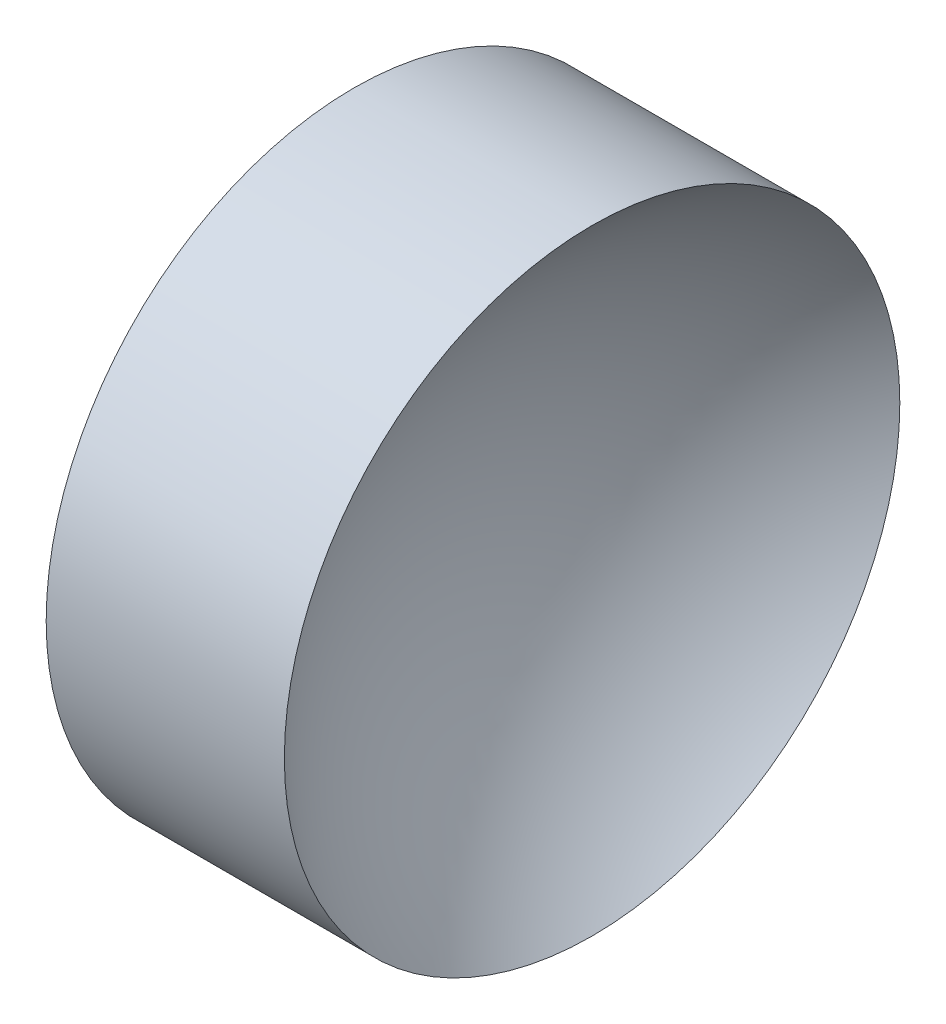
ISO-10303-21;
HEADER;
FILE_DESCRIPTION(('STEP AP214'),'2;1');
FILE_NAME('part.step','',(''),(''),'','','');
FILE_SCHEMA(('AUTOMOTIVE_DESIGN { 1 0 10303 214 1 1 1 1 }'));
ENDSEC;
DATA;
#1=APPLICATION_CONTEXT('core data for automotive mechanical design processes');
#2=APPLICATION_PROTOCOL_DEFINITION('international standard','automotive_design',2000,#1);
#3=PRODUCT_CONTEXT('',#1,'mechanical');
#4=PRODUCT('Part','Part','',(#3));
#5=PRODUCT_RELATED_PRODUCT_CATEGORY('part','',(#4));
#6=PRODUCT_DEFINITION_FORMATION('','',#4);
#7=PRODUCT_DEFINITION_CONTEXT('part definition',#1,'design');
#8=PRODUCT_DEFINITION('design','',#6,#7);
#9=PRODUCT_DEFINITION_SHAPE('','',#8);
#10=(LENGTH_UNIT() NAMED_UNIT(*) SI_UNIT(.MILLI.,.METRE.));
#11=(NAMED_UNIT(*) PLANE_ANGLE_UNIT() SI_UNIT($,.RADIAN.));
#12=(NAMED_UNIT(*) SI_UNIT($,.STERADIAN.) SOLID_ANGLE_UNIT());
#13=UNCERTAINTY_MEASURE_WITH_UNIT(LENGTH_MEASURE(1.E-05),#10,'distance_accuracy_value','');
#14=(GEOMETRIC_REPRESENTATION_CONTEXT(3) GLOBAL_UNCERTAINTY_ASSIGNED_CONTEXT((#13)) GLOBAL_UNIT_ASSIGNED_CONTEXT((#10,
#11,#12)) REPRESENTATION_CONTEXT('',''));
#15=CARTESIAN_POINT('',(0.,0.,0.));
#16=DIRECTION('',(0.,0.,1.));
#17=DIRECTION('',(1.,0.,0.));
#18=AXIS2_PLACEMENT_3D('',#15,#16,#17);
#19=CARTESIAN_POINT('',(52.2788471012858,26.089041149195,0.));
#20=DIRECTION('',(-1.,0.,0.));
#21=DIRECTION('',(0.,-1.,0.));
#22=AXIS2_PLACEMENT_3D('',#19,#20,#21);
#23=SPHERICAL_SURFACE('',#22,6.45926160337553);
#24=CARTESIAN_POINT('',(48.1895854979103,26.089041149195,0.));
#25=DIRECTION('',(-1.,0.,0.));
#26=DIRECTION('',(0.,0.,1.));
#27=AXIS2_PLACEMENT_3D('',#24,#25,#26);
#28=CIRCLE('',#27,5.);
#29=CARTESIAN_POINT('',(48.1895854979103,26.089041149195,5.));
#30=VERTEX_POINT('',#29);
#31=EDGE_CURVE('E10',#30,#30,#28,.T.);
#32=ORIENTED_EDGE('',*,*,#31,.F.);
#33=EDGE_LOOP('',(#32));
#34=FACE_BOUND('',#33,.T.);
#35=ADVANCED_FACE('F35',(#34),#23,.F.);
#36=CARTESIAN_POINT('',(42.4498611141368,26.089041149195,0.));
#37=DIRECTION('',(-1.,0.,0.));
#38=DIRECTION('',(0.,0.,1.));
#39=AXIS2_PLACEMENT_3D('',#36,#37,#38);
#40=CYLINDRICAL_SURFACE('',#39,5.);
#41=CARTESIAN_POINT('',(44.3195854979103,26.089041149195,0.));
#42=DIRECTION('',(-1.,0.,0.));
#43=DIRECTION('',(0.,0.,1.));
#44=AXIS2_PLACEMENT_3D('',#41,#42,#43);
#45=CIRCLE('',#44,5.);
#46=CARTESIAN_POINT('',(44.3195854979103,26.089041149195,5.));
#47=VERTEX_POINT('',#46);
#48=EDGE_CURVE('E41',#47,#47,#45,.T.);
#49=ORIENTED_EDGE('',*,*,#48,.F.);
#50=EDGE_LOOP('',(#49));
#51=FACE_BOUND('',#50,.T.);
#52=ORIENTED_EDGE('',*,*,#31,.T.);
#53=EDGE_LOOP('',(#52));
#54=FACE_BOUND('',#53,.T.);
#55=ADVANCED_FACE('F49',(#51,#54),#40,.T.);
#56=CARTESIAN_POINT('',(44.3195854979103,26.089041149195,0.));
#57=DIRECTION('',(1.,0.,0.));
#58=DIRECTION('',(0.,0.,-1.));
#59=AXIS2_PLACEMENT_3D('',#56,#57,#58);
#60=PLANE('',#59);
#61=ORIENTED_EDGE('',*,*,#48,.T.);
#62=EDGE_LOOP('',(#61));
#63=FACE_BOUND('',#62,.T.);
#64=ADVANCED_FACE('F47',(#63),#60,.F.);
#65=CLOSED_SHELL('',(#35,#55,#64));
#66=MANIFOLD_SOLID_BREP('B2',#65);
#67=ADVANCED_BREP_SHAPE_REPRESENTATION('',(#18,#66),#14);
#68=SHAPE_DEFINITION_REPRESENTATION(#9,#67);
ENDSEC;
END-ISO-10303-21;
